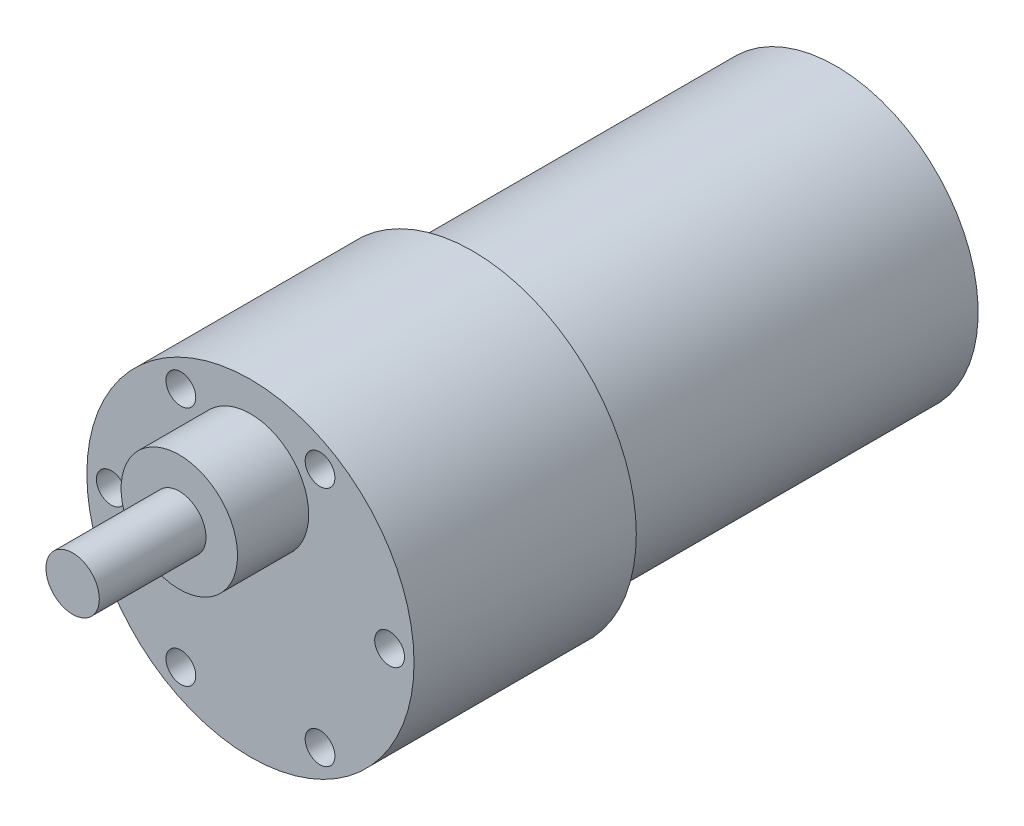
ISO-10303-21;
HEADER;
FILE_DESCRIPTION(('STEP AP214'),'2;1');
FILE_NAME('part.step','',(''),(''),'','','');
FILE_SCHEMA(('AUTOMOTIVE_DESIGN { 1 0 10303 214 1 1 1 1 }'));
ENDSEC;
DATA;
#1=APPLICATION_CONTEXT('core data for automotive mechanical design processes');
#2=APPLICATION_PROTOCOL_DEFINITION('international standard','automotive_design',2000,#1);
#3=PRODUCT_CONTEXT('',#1,'mechanical');
#4=PRODUCT('Part','Part','',(#3));
#5=PRODUCT_RELATED_PRODUCT_CATEGORY('part','',(#4));
#6=PRODUCT_DEFINITION_FORMATION('','',#4);
#7=PRODUCT_DEFINITION_CONTEXT('part definition',#1,'design');
#8=PRODUCT_DEFINITION('design','',#6,#7);
#9=PRODUCT_DEFINITION_SHAPE('','',#8);
#10=(LENGTH_UNIT() NAMED_UNIT(*) SI_UNIT(.MILLI.,.METRE.));
#11=(NAMED_UNIT(*) PLANE_ANGLE_UNIT() SI_UNIT($,.RADIAN.));
#12=(NAMED_UNIT(*) SI_UNIT($,.STERADIAN.) SOLID_ANGLE_UNIT());
#13=UNCERTAINTY_MEASURE_WITH_UNIT(LENGTH_MEASURE(1.E-05),#10,'distance_accuracy_value','');
#14=(GEOMETRIC_REPRESENTATION_CONTEXT(3) GLOBAL_UNCERTAINTY_ASSIGNED_CONTEXT((#13)) GLOBAL_UNIT_ASSIGNED_CONTEXT((#10,
#11,#12)) REPRESENTATION_CONTEXT('',''));
#15=CARTESIAN_POINT('',(0.,0.,0.));
#16=DIRECTION('',(0.,0.,1.));
#17=DIRECTION('',(1.,0.,0.));
#18=AXIS2_PLACEMENT_3D('',#15,#16,#17);
#19=CARTESIAN_POINT('',(0.,0.,-25.));
#20=DIRECTION('',(0.,0.,1.));
#21=DIRECTION('',(1.,0.,0.));
#22=AXIS2_PLACEMENT_3D('',#19,#20,#21);
#23=CYLINDRICAL_SURFACE('',#22,18.4);
#24=CARTESIAN_POINT('',(0.,0.,-25.));
#25=DIRECTION('',(0.,0.,1.));
#26=DIRECTION('',(1.,0.,0.));
#27=AXIS2_PLACEMENT_3D('',#24,#25,#26);
#28=CIRCLE('',#27,18.4);
#29=CARTESIAN_POINT('',(18.4,0.,-25.));
#30=VERTEX_POINT('',#29);
#31=EDGE_CURVE('E51',#30,#30,#28,.T.);
#32=ORIENTED_EDGE('',*,*,#31,.T.);
#33=EDGE_LOOP('',(#32));
#34=FACE_BOUND('',#33,.T.);
#35=CARTESIAN_POINT('',(0.,0.,0.));
#36=DIRECTION('',(0.,0.,1.));
#37=DIRECTION('',(1.,0.,0.));
#38=AXIS2_PLACEMENT_3D('',#35,#36,#37);
#39=CIRCLE('',#38,18.4);
#40=CARTESIAN_POINT('',(18.4,0.,0.));
#41=VERTEX_POINT('',#40);
#42=EDGE_CURVE('E40',#41,#41,#39,.T.);
#43=ORIENTED_EDGE('',*,*,#42,.F.);
#44=EDGE_LOOP('',(#43));
#45=FACE_BOUND('',#44,.T.);
#46=ADVANCED_FACE('F37',(#34,#45),#23,.T.);
#47=CARTESIAN_POINT('',(0.,0.,-25.));
#48=DIRECTION('',(0.,0.,1.));
#49=DIRECTION('',(1.,0.,0.));
#50=AXIS2_PLACEMENT_3D('',#47,#48,#49);
#51=PLANE('',#50);
#52=CARTESIAN_POINT('',(0.,0.,-25.));
#53=DIRECTION('',(0.,0.,-1.));
#54=DIRECTION('',(-1.,0.,0.));
#55=AXIS2_PLACEMENT_3D('',#52,#53,#54);
#56=CIRCLE('',#55,16.);
#57=CARTESIAN_POINT('',(-16.,0.,-25.));
#58=VERTEX_POINT('',#57);
#59=EDGE_CURVE('E45',#58,#58,#56,.T.);
#60=ORIENTED_EDGE('',*,*,#59,.F.);
#61=EDGE_LOOP('',(#60));
#62=FACE_BOUND('',#61,.T.);
#63=ORIENTED_EDGE('',*,*,#31,.F.);
#64=EDGE_LOOP('',(#63));
#65=FACE_BOUND('',#64,.T.);
#66=ADVANCED_FACE('F126',(#62,#65),#51,.F.);
#67=CARTESIAN_POINT('',(0.,0.,0.));
#68=DIRECTION('',(0.,0.,1.));
#69=DIRECTION('',(1.,0.,0.));
#70=AXIS2_PLACEMENT_3D('',#67,#68,#69);
#71=PLANE('',#70);
#72=CARTESIAN_POINT('',(0.,8.5,0.));
#73=DIRECTION('',(0.,0.,1.));
#74=DIRECTION('',(1.,0.,0.));
#75=AXIS2_PLACEMENT_3D('',#72,#73,#74);
#76=CIRCLE('',#75,6.55);
#77=CARTESIAN_POINT('',(6.55,8.5,0.));
#78=VERTEX_POINT('',#77);
#79=EDGE_CURVE('E61',#78,#78,#76,.T.);
#80=ORIENTED_EDGE('',*,*,#79,.F.);
#81=EDGE_LOOP('',(#80));
#82=FACE_BOUND('',#81,.T.);
#83=CARTESIAN_POINT('',(15.65,0.,0.));
#84=DIRECTION('',(0.,0.,1.));
#85=DIRECTION('',(1.,0.,0.));
#86=AXIS2_PLACEMENT_3D('',#83,#84,#85);
#87=CIRCLE('',#86,1.675);
#88=CARTESIAN_POINT('',(17.325,0.,0.));
#89=VERTEX_POINT('',#88);
#90=EDGE_CURVE('E70',#89,#89,#87,.T.);
#91=ORIENTED_EDGE('',*,*,#90,.F.);
#92=EDGE_LOOP('',(#91));
#93=FACE_BOUND('',#92,.T.);
#94=CARTESIAN_POINT('',(7.82499999999999,13.5532975692265,0.));
#95=DIRECTION('',(0.,0.,1.));
#96=DIRECTION('',(1.,0.,0.));
#97=AXIS2_PLACEMENT_3D('',#94,#95,#96);
#98=CIRCLE('',#97,1.675);
#99=CARTESIAN_POINT('',(9.5,13.5532975692265,0.));
#100=VERTEX_POINT('',#99);
#101=EDGE_CURVE('E60',#100,#100,#98,.T.);
#102=ORIENTED_EDGE('',*,*,#101,.F.);
#103=EDGE_LOOP('',(#102));
#104=FACE_BOUND('',#103,.T.);
#105=CARTESIAN_POINT('',(-7.82500000000001,13.5532975692265,0.));
#106=DIRECTION('',(0.,0.,1.));
#107=DIRECTION('',(1.,0.,0.));
#108=AXIS2_PLACEMENT_3D('',#105,#106,#107);
#109=CIRCLE('',#108,1.675);
#110=CARTESIAN_POINT('',(-6.15,13.5532975692265,0.));
#111=VERTEX_POINT('',#110);
#112=EDGE_CURVE('E79',#111,#111,#109,.T.);
#113=ORIENTED_EDGE('',*,*,#112,.F.);
#114=EDGE_LOOP('',(#113));
#115=FACE_BOUND('',#114,.T.);
#116=CARTESIAN_POINT('',(-15.65,0.,0.));
#117=DIRECTION('',(0.,0.,1.));
#118=DIRECTION('',(1.,0.,0.));
#119=AXIS2_PLACEMENT_3D('',#116,#117,#118);
#120=CIRCLE('',#119,1.675);
#121=CARTESIAN_POINT('',(-13.975,0.,0.));
#122=VERTEX_POINT('',#121);
#123=EDGE_CURVE('E102',#122,#122,#120,.T.);
#124=ORIENTED_EDGE('',*,*,#123,.F.);
#125=EDGE_LOOP('',(#124));
#126=FACE_BOUND('',#125,.T.);
#127=CARTESIAN_POINT('',(-7.825,-13.5532975692265,0.));
#128=DIRECTION('',(0.,0.,1.));
#129=DIRECTION('',(1.,0.,0.));
#130=AXIS2_PLACEMENT_3D('',#127,#128,#129);
#131=CIRCLE('',#130,1.67500000000001);
#132=CARTESIAN_POINT('',(-6.14999999999999,-13.5532975692265,0.));
#133=VERTEX_POINT('',#132);
#134=EDGE_CURVE('E94',#133,#133,#131,.T.);
#135=ORIENTED_EDGE('',*,*,#134,.F.);
#136=EDGE_LOOP('',(#135));
#137=FACE_BOUND('',#136,.T.);
#138=CARTESIAN_POINT('',(7.825,-13.5532975692265,0.));
#139=DIRECTION('',(0.,0.,1.));
#140=DIRECTION('',(1.,0.,0.));
#141=AXIS2_PLACEMENT_3D('',#138,#139,#140);
#142=CIRCLE('',#141,1.675);
#143=CARTESIAN_POINT('',(9.50000000000001,-13.5532975692265,0.));
#144=VERTEX_POINT('',#143);
#145=EDGE_CURVE('E86',#144,#144,#142,.T.);
#146=ORIENTED_EDGE('',*,*,#145,.F.);
#147=EDGE_LOOP('',(#146));
#148=FACE_BOUND('',#147,.T.);
#149=ORIENTED_EDGE('',*,*,#42,.T.);
#150=EDGE_LOOP('',(#149));
#151=FACE_BOUND('',#150,.T.);
#152=ADVANCED_FACE('F123',(#82,#93,#104,#115,#126,#137,#148,#151),#71,.T.);
#153=CARTESIAN_POINT('',(0.,0.,-65.85));
#154=DIRECTION('',(0.,0.,1.));
#155=DIRECTION('',(1.,0.,0.));
#156=AXIS2_PLACEMENT_3D('',#153,#154,#155);
#157=CYLINDRICAL_SURFACE('',#156,16.);
#158=CARTESIAN_POINT('',(0.,0.,-65.85));
#159=DIRECTION('',(0.,0.,-1.));
#160=DIRECTION('',(-1.,0.,0.));
#161=AXIS2_PLACEMENT_3D('',#158,#159,#160);
#162=CIRCLE('',#161,16.);
#163=CARTESIAN_POINT('',(-16.,0.,-65.85));
#164=VERTEX_POINT('',#163);
#165=EDGE_CURVE('E69',#164,#164,#162,.T.);
#166=ORIENTED_EDGE('',*,*,#165,.F.);
#167=EDGE_LOOP('',(#166));
#168=FACE_BOUND('',#167,.T.);
#169=ORIENTED_EDGE('',*,*,#59,.T.);
#170=EDGE_LOOP('',(#169));
#171=FACE_BOUND('',#170,.T.);
#172=ADVANCED_FACE('F135',(#168,#171),#157,.T.);
#173=CARTESIAN_POINT('',(0.,0.,-65.85));
#174=DIRECTION('',(0.,0.,-1.));
#175=DIRECTION('',(-1.,0.,0.));
#176=AXIS2_PLACEMENT_3D('',#173,#174,#175);
#177=PLANE('',#176);
#178=ORIENTED_EDGE('',*,*,#165,.T.);
#179=EDGE_LOOP('',(#178));
#180=FACE_BOUND('',#179,.T.);
#181=ADVANCED_FACE('F142',(#180),#177,.T.);
#182=CARTESIAN_POINT('',(7.825,-13.5532975692265,-10.));
#183=DIRECTION('',(0.,0.,1.));
#184=DIRECTION('',(1.,0.,0.));
#185=AXIS2_PLACEMENT_3D('',#182,#183,#184);
#186=CYLINDRICAL_SURFACE('',#185,1.675);
#187=CARTESIAN_POINT('',(7.825,-13.5532975692265,-10.));
#188=DIRECTION('',(0.,0.,1.));
#189=DIRECTION('',(1.,0.,0.));
#190=AXIS2_PLACEMENT_3D('',#187,#188,#189);
#191=CIRCLE('',#190,1.675);
#192=CARTESIAN_POINT('',(9.50000000000001,-13.5532975692265,-10.));
#193=VERTEX_POINT('',#192);
#194=EDGE_CURVE('E74',#193,#193,#191,.T.);
#195=ORIENTED_EDGE('',*,*,#194,.F.);
#196=EDGE_LOOP('',(#195));
#197=FACE_BOUND('',#196,.T.);
#198=ORIENTED_EDGE('',*,*,#145,.T.);
#199=EDGE_LOOP('',(#198));
#200=FACE_BOUND('',#199,.T.);
#201=ADVANCED_FACE('F146',(#197,#200),#186,.F.);
#202=CARTESIAN_POINT('',(7.825,-13.5532975692265,-10.));
#203=DIRECTION('',(0.,0.,1.));
#204=DIRECTION('',(1.,0.,0.));
#205=AXIS2_PLACEMENT_3D('',#202,#203,#204);
#206=PLANE('',#205);
#207=ORIENTED_EDGE('',*,*,#194,.T.);
#208=EDGE_LOOP('',(#207));
#209=FACE_BOUND('',#208,.T.);
#210=ADVANCED_FACE('F169',(#209),#206,.T.);
#211=CARTESIAN_POINT('',(-7.825,-13.5532975692265,-10.));
#212=DIRECTION('',(0.,0.,1.));
#213=DIRECTION('',(1.,0.,0.));
#214=AXIS2_PLACEMENT_3D('',#211,#212,#213);
#215=CYLINDRICAL_SURFACE('',#214,1.67500000000001);
#216=CARTESIAN_POINT('',(-7.825,-13.5532975692265,-10.));
#217=DIRECTION('',(0.,0.,1.));
#218=DIRECTION('',(1.,0.,0.));
#219=AXIS2_PLACEMENT_3D('',#216,#217,#218);
#220=CIRCLE('',#219,1.67500000000001);
#221=CARTESIAN_POINT('',(-6.14999999999999,-13.5532975692265,-10.));
#222=VERTEX_POINT('',#221);
#223=EDGE_CURVE('E90',#222,#222,#220,.T.);
#224=ORIENTED_EDGE('',*,*,#223,.F.);
#225=EDGE_LOOP('',(#224));
#226=FACE_BOUND('',#225,.T.);
#227=ORIENTED_EDGE('',*,*,#134,.T.);
#228=EDGE_LOOP('',(#227));
#229=FACE_BOUND('',#228,.T.);
#230=ADVANCED_FACE('F166',(#226,#229),#215,.F.);
#231=CARTESIAN_POINT('',(-7.825,-13.5532975692265,-10.));
#232=DIRECTION('',(0.,0.,1.));
#233=DIRECTION('',(1.,0.,0.));
#234=AXIS2_PLACEMENT_3D('',#231,#232,#233);
#235=PLANE('',#234);
#236=ORIENTED_EDGE('',*,*,#223,.T.);
#237=EDGE_LOOP('',(#236));
#238=FACE_BOUND('',#237,.T.);
#239=ADVANCED_FACE('F161',(#238),#235,.T.);
#240=CARTESIAN_POINT('',(-15.65,0.,-10.));
#241=DIRECTION('',(0.,0.,1.));
#242=DIRECTION('',(1.,0.,0.));
#243=AXIS2_PLACEMENT_3D('',#240,#241,#242);
#244=CYLINDRICAL_SURFACE('',#243,1.675);
#245=CARTESIAN_POINT('',(-15.65,0.,-10.));
#246=DIRECTION('',(0.,0.,1.));
#247=DIRECTION('',(1.,0.,0.));
#248=AXIS2_PLACEMENT_3D('',#245,#246,#247);
#249=CIRCLE('',#248,1.675);
#250=CARTESIAN_POINT('',(-13.975,0.,-10.));
#251=VERTEX_POINT('',#250);
#252=EDGE_CURVE('E98',#251,#251,#249,.T.);
#253=ORIENTED_EDGE('',*,*,#252,.F.);
#254=EDGE_LOOP('',(#253));
#255=FACE_BOUND('',#254,.T.);
#256=ORIENTED_EDGE('',*,*,#123,.T.);
#257=EDGE_LOOP('',(#256));
#258=FACE_BOUND('',#257,.T.);
#259=ADVANCED_FACE('F158',(#255,#258),#244,.F.);
#260=CARTESIAN_POINT('',(-15.65,0.,-10.));
#261=DIRECTION('',(0.,0.,1.));
#262=DIRECTION('',(1.,0.,0.));
#263=AXIS2_PLACEMENT_3D('',#260,#261,#262);
#264=PLANE('',#263);
#265=ORIENTED_EDGE('',*,*,#252,.T.);
#266=EDGE_LOOP('',(#265));
#267=FACE_BOUND('',#266,.T.);
#268=ADVANCED_FACE('F152',(#267),#264,.T.);
#269=CARTESIAN_POINT('',(-7.82500000000001,13.5532975692265,-10.));
#270=DIRECTION('',(0.,0.,1.));
#271=DIRECTION('',(1.,0.,0.));
#272=AXIS2_PLACEMENT_3D('',#269,#270,#271);
#273=CYLINDRICAL_SURFACE('',#272,1.675);
#274=CARTESIAN_POINT('',(-7.82500000000001,13.5532975692265,-10.));
#275=DIRECTION('',(0.,0.,1.));
#276=DIRECTION('',(1.,0.,0.));
#277=AXIS2_PLACEMENT_3D('',#274,#275,#276);
#278=CIRCLE('',#277,1.675);
#279=CARTESIAN_POINT('',(-6.15,13.5532975692265,-10.));
#280=VERTEX_POINT('',#279);
#281=EDGE_CURVE('E106',#280,#280,#278,.T.);
#282=ORIENTED_EDGE('',*,*,#281,.F.);
#283=EDGE_LOOP('',(#282));
#284=FACE_BOUND('',#283,.T.);
#285=ORIENTED_EDGE('',*,*,#112,.T.);
#286=EDGE_LOOP('',(#285));
#287=FACE_BOUND('',#286,.T.);
#288=ADVANCED_FACE('F148',(#284,#287),#273,.F.);
#289=CARTESIAN_POINT('',(-7.82500000000001,13.5532975692265,-10.));
#290=DIRECTION('',(0.,0.,1.));
#291=DIRECTION('',(1.,0.,0.));
#292=AXIS2_PLACEMENT_3D('',#289,#290,#291);
#293=PLANE('',#292);
#294=ORIENTED_EDGE('',*,*,#281,.T.);
#295=EDGE_LOOP('',(#294));
#296=FACE_BOUND('',#295,.T.);
#297=ADVANCED_FACE('F151',(#296),#293,.T.);
#298=CARTESIAN_POINT('',(7.82499999999999,13.5532975692265,-10.));
#299=DIRECTION('',(0.,0.,1.));
#300=DIRECTION('',(1.,0.,0.));
#301=AXIS2_PLACEMENT_3D('',#298,#299,#300);
#302=CYLINDRICAL_SURFACE('',#301,1.675);
#303=CARTESIAN_POINT('',(7.82499999999999,13.5532975692265,-10.));
#304=DIRECTION('',(0.,0.,1.));
#305=DIRECTION('',(1.,0.,0.));
#306=AXIS2_PLACEMENT_3D('',#303,#304,#305);
#307=CIRCLE('',#306,1.675);
#308=CARTESIAN_POINT('',(9.5,13.5532975692265,-10.));
#309=VERTEX_POINT('',#308);
#310=EDGE_CURVE('E75',#309,#309,#307,.T.);
#311=ORIENTED_EDGE('',*,*,#310,.F.);
#312=EDGE_LOOP('',(#311));
#313=FACE_BOUND('',#312,.T.);
#314=ORIENTED_EDGE('',*,*,#101,.T.);
#315=EDGE_LOOP('',(#314));
#316=FACE_BOUND('',#315,.T.);
#317=ADVANCED_FACE('F156',(#313,#316),#302,.F.);
#318=CARTESIAN_POINT('',(7.82499999999999,13.5532975692265,-10.));
#319=DIRECTION('',(0.,0.,1.));
#320=DIRECTION('',(1.,0.,0.));
#321=AXIS2_PLACEMENT_3D('',#318,#319,#320);
#322=PLANE('',#321);
#323=ORIENTED_EDGE('',*,*,#310,.T.);
#324=EDGE_LOOP('',(#323));
#325=FACE_BOUND('',#324,.T.);
#326=ADVANCED_FACE('F182',(#325),#322,.T.);
#327=CARTESIAN_POINT('',(15.65,0.,-10.));
#328=DIRECTION('',(0.,0.,1.));
#329=DIRECTION('',(1.,0.,0.));
#330=AXIS2_PLACEMENT_3D('',#327,#328,#329);
#331=CYLINDRICAL_SURFACE('',#330,1.675);
#332=CARTESIAN_POINT('',(15.65,0.,-10.));
#333=DIRECTION('',(0.,0.,1.));
#334=DIRECTION('',(1.,0.,0.));
#335=AXIS2_PLACEMENT_3D('',#332,#333,#334);
#336=CIRCLE('',#335,1.675);
#337=CARTESIAN_POINT('',(17.325,0.,-10.));
#338=VERTEX_POINT('',#337);
#339=EDGE_CURVE('E65',#338,#338,#336,.T.);
#340=ORIENTED_EDGE('',*,*,#339,.F.);
#341=EDGE_LOOP('',(#340));
#342=FACE_BOUND('',#341,.T.);
#343=ORIENTED_EDGE('',*,*,#90,.T.);
#344=EDGE_LOOP('',(#343));
#345=FACE_BOUND('',#344,.T.);
#346=ADVANCED_FACE('F186',(#342,#345),#331,.F.);
#347=CARTESIAN_POINT('',(15.65,0.,-10.));
#348=DIRECTION('',(0.,0.,1.));
#349=DIRECTION('',(1.,0.,0.));
#350=AXIS2_PLACEMENT_3D('',#347,#348,#349);
#351=PLANE('',#350);
#352=ORIENTED_EDGE('',*,*,#339,.T.);
#353=EDGE_LOOP('',(#352));
#354=FACE_BOUND('',#353,.T.);
#355=ADVANCED_FACE('F190',(#354),#351,.T.);
#356=CARTESIAN_POINT('',(0.,8.5,8.));
#357=DIRECTION('',(0.,0.,-1.));
#358=DIRECTION('',(-1.,0.,0.));
#359=AXIS2_PLACEMENT_3D('',#356,#357,#358);
#360=CYLINDRICAL_SURFACE('',#359,6.55);
#361=CARTESIAN_POINT('',(0.,8.5,8.));
#362=DIRECTION('',(0.,0.,1.));
#363=DIRECTION('',(1.,0.,0.));
#364=AXIS2_PLACEMENT_3D('',#361,#362,#363);
#365=CIRCLE('',#364,6.55);
#366=CARTESIAN_POINT('',(6.55,8.5,8.));
#367=VERTEX_POINT('',#366);
#368=EDGE_CURVE('E56',#367,#367,#365,.T.);
#369=ORIENTED_EDGE('',*,*,#368,.F.);
#370=EDGE_LOOP('',(#369));
#371=FACE_BOUND('',#370,.T.);
#372=ORIENTED_EDGE('',*,*,#79,.T.);
#373=EDGE_LOOP('',(#372));
#374=FACE_BOUND('',#373,.T.);
#375=ADVANCED_FACE('F194',(#371,#374),#360,.T.);
#376=CARTESIAN_POINT('',(0.,8.5,8.));
#377=DIRECTION('',(0.,0.,1.));
#378=DIRECTION('',(1.,0.,0.));
#379=AXIS2_PLACEMENT_3D('',#376,#377,#378);
#380=PLANE('',#379);
#381=CARTESIAN_POINT('',(0.,8.5,8.));
#382=DIRECTION('',(0.,0.,1.));
#383=DIRECTION('',(1.,0.,0.));
#384=AXIS2_PLACEMENT_3D('',#381,#382,#383);
#385=CIRCLE('',#384,3.);
#386=CARTESIAN_POINT('',(3.,8.5,8.));
#387=VERTEX_POINT('',#386);
#388=EDGE_CURVE('E10',#387,#387,#385,.T.);
#389=ORIENTED_EDGE('',*,*,#388,.F.);
#390=EDGE_LOOP('',(#389));
#391=FACE_BOUND('',#390,.T.);
#392=ORIENTED_EDGE('',*,*,#368,.T.);
#393=EDGE_LOOP('',(#392));
#394=FACE_BOUND('',#393,.T.);
#395=ADVANCED_FACE('F198',(#391,#394),#380,.T.);
#396=CARTESIAN_POINT('',(0.,8.5,20.));
#397=DIRECTION('',(0.,0.,-1.));
#398=DIRECTION('',(-1.,0.,0.));
#399=AXIS2_PLACEMENT_3D('',#396,#397,#398);
#400=CYLINDRICAL_SURFACE('',#399,3.);
#401=CARTESIAN_POINT('',(0.,8.5,20.));
#402=DIRECTION('',(0.,0.,1.));
#403=DIRECTION('',(1.,0.,0.));
#404=AXIS2_PLACEMENT_3D('',#401,#402,#403);
#405=CIRCLE('',#404,3.);
#406=CARTESIAN_POINT('',(3.,8.5,20.));
#407=VERTEX_POINT('',#406);
#408=EDGE_CURVE('E55',#407,#407,#405,.T.);
#409=ORIENTED_EDGE('',*,*,#408,.F.);
#410=EDGE_LOOP('',(#409));
#411=FACE_BOUND('',#410,.T.);
#412=ORIENTED_EDGE('',*,*,#388,.T.);
#413=EDGE_LOOP('',(#412));
#414=FACE_BOUND('',#413,.T.);
#415=ADVANCED_FACE('F202',(#411,#414),#400,.T.);
#416=CARTESIAN_POINT('',(0.,8.5,20.));
#417=DIRECTION('',(0.,0.,1.));
#418=DIRECTION('',(1.,0.,0.));
#419=AXIS2_PLACEMENT_3D('',#416,#417,#418);
#420=PLANE('',#419);
#421=ORIENTED_EDGE('',*,*,#408,.T.);
#422=EDGE_LOOP('',(#421));
#423=FACE_BOUND('',#422,.T.);
#424=ADVANCED_FACE('F206',(#423),#420,.T.);
#425=CLOSED_SHELL('',(#46,#66,#152,#172,#181,#201,#210,#230,#239,#259,#268,#288,#297,#317,#326,
#346,#355,#375,#395,#415,#424));
#426=MANIFOLD_SOLID_BREP('B2',#425);
#427=ADVANCED_BREP_SHAPE_REPRESENTATION('',(#18,#426),#14);
#428=SHAPE_DEFINITION_REPRESENTATION(#9,#427);
ENDSEC;
END-ISO-10303-21;
